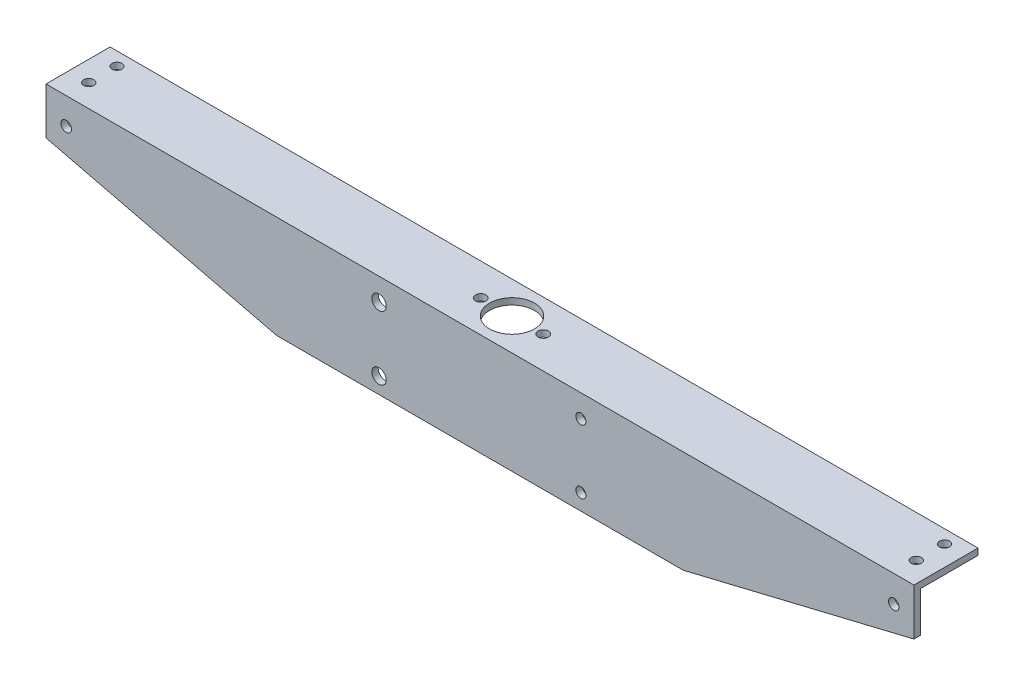
ISO-10303-21;
HEADER;
FILE_DESCRIPTION(('STEP AP214'),'2;1');
FILE_NAME('part.step','',(''),(''),'','','');
FILE_SCHEMA(('AUTOMOTIVE_DESIGN { 1 0 10303 214 1 1 1 1 }'));
ENDSEC;
DATA;
#1=APPLICATION_CONTEXT('core data for automotive mechanical design processes');
#2=APPLICATION_PROTOCOL_DEFINITION('international standard','automotive_design',2000,#1);
#3=PRODUCT_CONTEXT('',#1,'mechanical');
#4=PRODUCT('Part','Part','',(#3));
#5=PRODUCT_RELATED_PRODUCT_CATEGORY('part','',(#4));
#6=PRODUCT_DEFINITION_FORMATION('','',#4);
#7=PRODUCT_DEFINITION_CONTEXT('part definition',#1,'design');
#8=PRODUCT_DEFINITION('design','',#6,#7);
#9=PRODUCT_DEFINITION_SHAPE('','',#8);
#10=(LENGTH_UNIT() NAMED_UNIT(*) SI_UNIT(.MILLI.,.METRE.));
#11=(NAMED_UNIT(*) PLANE_ANGLE_UNIT() SI_UNIT($,.RADIAN.));
#12=(NAMED_UNIT(*) SI_UNIT($,.STERADIAN.) SOLID_ANGLE_UNIT());
#13=UNCERTAINTY_MEASURE_WITH_UNIT(LENGTH_MEASURE(1.E-05),#10,'distance_accuracy_value','');
#14=(GEOMETRIC_REPRESENTATION_CONTEXT(3) GLOBAL_UNCERTAINTY_ASSIGNED_CONTEXT((#13)) GLOBAL_UNIT_ASSIGNED_CONTEXT((#10,
#11,#12)) REPRESENTATION_CONTEXT('',''));
#15=CARTESIAN_POINT('',(0.,0.,0.));
#16=DIRECTION('',(0.,0.,1.));
#17=DIRECTION('',(1.,0.,0.));
#18=AXIS2_PLACEMENT_3D('',#15,#16,#17);
#19=CARTESIAN_POINT('',(215.,-50.8,0.));
#20=DIRECTION('',(0.,0.,-1.));
#21=DIRECTION('',(-1.,0.,0.));
#22=AXIS2_PLACEMENT_3D('',#19,#20,#21);
#23=PLANE('',#22);
#24=CARTESIAN_POINT('',(-205.,-13.1750000660001,0.));
#25=DIRECTION('',(0.,0.,1.));
#26=DIRECTION('',(-1.,0.,0.));
#27=AXIS2_PLACEMENT_3D('',#24,#25,#26);
#28=CIRCLE('',#27,2.59999999999999);
#29=CARTESIAN_POINT('',(-207.6,-13.1750000660001,0.));
#30=VERTEX_POINT('',#29);
#31=EDGE_CURVE('E213',#30,#30,#28,.T.);
#32=ORIENTED_EDGE('',*,*,#31,.F.);
#33=EDGE_LOOP('',(#32));
#34=FACE_BOUND('',#33,.T.);
#35=CARTESIAN_POINT('',(205.,-13.175000066,0.));
#36=DIRECTION('',(0.,0.,1.));
#37=DIRECTION('',(1.,0.,0.));
#38=AXIS2_PLACEMENT_3D('',#35,#36,#37);
#39=CIRCLE('',#38,2.59999999999999);
#40=CARTESIAN_POINT('',(207.6,-13.175000066,0.));
#41=VERTEX_POINT('',#40);
#42=EDGE_CURVE('E217',#41,#41,#39,.T.);
#43=ORIENTED_EDGE('',*,*,#42,.F.);
#44=EDGE_LOOP('',(#43));
#45=FACE_BOUND('',#44,.T.);
#46=CARTESIAN_POINT('',(50.,-42.8,0.));
#47=DIRECTION('',(0.,0.,-1.));
#48=DIRECTION('',(0.,1.,0.));
#49=AXIS2_PLACEMENT_3D('',#46,#47,#48);
#50=CIRCLE('',#49,2.5);
#51=CARTESIAN_POINT('',(50.,-40.3,0.));
#52=VERTEX_POINT('',#51);
#53=EDGE_CURVE('E167',#52,#52,#50,.T.);
#54=ORIENTED_EDGE('',*,*,#53,.T.);
#55=EDGE_LOOP('',(#54));
#56=FACE_BOUND('',#55,.T.);
#57=CARTESIAN_POINT('',(-50.,-42.8,0.));
#58=DIRECTION('',(0.,0.,-1.));
#59=DIRECTION('',(0.,1.,0.));
#60=AXIS2_PLACEMENT_3D('',#57,#58,#59);
#61=CIRCLE('',#60,3.57);
#62=CARTESIAN_POINT('',(-50.,-39.23,0.));
#63=VERTEX_POINT('',#62);
#64=EDGE_CURVE('E175',#63,#63,#61,.T.);
#65=ORIENTED_EDGE('',*,*,#64,.T.);
#66=EDGE_LOOP('',(#65));
#67=FACE_BOUND('',#66,.T.);
#68=CARTESIAN_POINT('',(-50.,-11.175,0.));
#69=DIRECTION('',(0.,0.,-1.));
#70=DIRECTION('',(0.,1.,0.));
#71=AXIS2_PLACEMENT_3D('',#68,#69,#70);
#72=CIRCLE('',#71,3.57);
#73=CARTESIAN_POINT('',(-50.,-7.60500000000001,0.));
#74=VERTEX_POINT('',#73);
#75=EDGE_CURVE('E181',#74,#74,#72,.T.);
#76=ORIENTED_EDGE('',*,*,#75,.T.);
#77=EDGE_LOOP('',(#76));
#78=FACE_BOUND('',#77,.T.);
#79=CARTESIAN_POINT('',(50.,-11.175,0.));
#80=DIRECTION('',(0.,0.,-1.));
#81=DIRECTION('',(0.,1.,0.));
#82=AXIS2_PLACEMENT_3D('',#79,#80,#81);
#83=CIRCLE('',#82,2.5);
#84=CARTESIAN_POINT('',(50.,-8.675,0.));
#85=VERTEX_POINT('',#84);
#86=EDGE_CURVE('E136',#85,#85,#83,.T.);
#87=ORIENTED_EDGE('',*,*,#86,.T.);
#88=EDGE_LOOP('',(#87));
#89=FACE_BOUND('',#88,.T.);
#90=DIRECTION('',(-1.,0.,0.));
#91=VECTOR('',#90,1.);
#92=CARTESIAN_POINT('',(215.,-50.8,0.));
#93=LINE('',#92,#91);
#94=CARTESIAN_POINT('',(100.7,-50.8000000000001,0.));
#95=VERTEX_POINT('',#94);
#96=CARTESIAN_POINT('',(-100.7,-50.8,0.));
#97=VERTEX_POINT('',#96);
#98=EDGE_CURVE('E11',#95,#97,#93,.T.);
#99=ORIENTED_EDGE('',*,*,#98,.F.);
#100=DIRECTION('',(0.972013609099375,0.234924549005864,0.));
#101=VECTOR('',#100,1.);
#102=CARTESIAN_POINT('',(100.7,-50.8000000000001,0.));
#103=LINE('',#102,#101);
#104=CARTESIAN_POINT('',(215.,-23.1750000000001,0.));
#105=VERTEX_POINT('',#104);
#106=EDGE_CURVE('E99',#95,#105,#103,.T.);
#107=ORIENTED_EDGE('',*,*,#106,.T.);
#108=DIRECTION('',(0.,-1.,0.));
#109=VECTOR('',#108,1.);
#110=CARTESIAN_POINT('',(215.,-50.8,0.));
#111=LINE('',#110,#109);
#112=CARTESIAN_POINT('',(215.,0.,0.));
#113=VERTEX_POINT('',#112);
#114=EDGE_CURVE('E110',#113,#105,#111,.T.);
#115=ORIENTED_EDGE('',*,*,#114,.F.);
#116=DIRECTION('',(-1.,0.,0.));
#117=VECTOR('',#116,1.);
#118=CARTESIAN_POINT('',(215.,0.,0.));
#119=LINE('',#118,#117);
#120=CARTESIAN_POINT('',(-215.,0.,0.));
#121=VERTEX_POINT('',#120);
#122=EDGE_CURVE('E131',#113,#121,#119,.T.);
#123=ORIENTED_EDGE('',*,*,#122,.T.);
#124=DIRECTION('',(0.,-1.,0.));
#125=VECTOR('',#124,1.);
#126=CARTESIAN_POINT('',(-215.,-50.8,0.));
#127=LINE('',#126,#125);
#128=CARTESIAN_POINT('',(-215.,-23.175,0.));
#129=VERTEX_POINT('',#128);
#130=EDGE_CURVE('E132',#121,#129,#127,.T.);
#131=ORIENTED_EDGE('',*,*,#130,.T.);
#132=DIRECTION('',(0.972013609099375,-0.234924549005864,0.));
#133=VECTOR('',#132,1.);
#134=CARTESIAN_POINT('',(-100.7,-50.8,0.));
#135=LINE('',#134,#133);
#136=EDGE_CURVE('E57',#129,#97,#135,.T.);
#137=ORIENTED_EDGE('',*,*,#136,.T.);
#138=EDGE_LOOP('',(#99,#107,#115,#123,#131,#137));
#139=FACE_BOUND('',#138,.T.);
#140=ADVANCED_FACE('F35',(#34,#45,#56,#67,#78,#89,#139),#23,.F.);
#141=CARTESIAN_POINT('',(215.,-50.8,-3.175));
#142=DIRECTION('',(0.,1.,0.));
#143=DIRECTION('',(0.,0.,1.));
#144=AXIS2_PLACEMENT_3D('',#141,#142,#143);
#145=PLANE('',#144);
#146=DIRECTION('',(-1.,0.,0.));
#147=VECTOR('',#146,1.);
#148=CARTESIAN_POINT('',(215.,-50.8,-3.175));
#149=LINE('',#148,#147);
#150=CARTESIAN_POINT('',(100.7,-50.8000000000001,-3.175));
#151=VERTEX_POINT('',#150);
#152=CARTESIAN_POINT('',(-100.7,-50.8,-3.175));
#153=VERTEX_POINT('',#152);
#154=EDGE_CURVE('E42',#151,#153,#149,.T.);
#155=ORIENTED_EDGE('',*,*,#154,.F.);
#156=DIRECTION('',(0.,0.,-1.));
#157=VECTOR('',#156,1.);
#158=CARTESIAN_POINT('',(100.7,-50.8000000000001,0.));
#159=LINE('',#158,#157);
#160=EDGE_CURVE('E104',#95,#151,#159,.T.);
#161=ORIENTED_EDGE('',*,*,#160,.F.);
#162=ORIENTED_EDGE('',*,*,#98,.T.);
#163=DIRECTION('',(0.,0.,-1.));
#164=VECTOR('',#163,1.);
#165=CARTESIAN_POINT('',(-100.7,-50.8,0.));
#166=LINE('',#165,#164);
#167=EDGE_CURVE('E160',#97,#153,#166,.T.);
#168=ORIENTED_EDGE('',*,*,#167,.T.);
#169=EDGE_LOOP('',(#155,#161,#162,#168));
#170=FACE_BOUND('',#169,.T.);
#171=ADVANCED_FACE('F163',(#170),#145,.F.);
#172=CARTESIAN_POINT('',(215.,-3.175,-3.17499999999999));
#173=DIRECTION('',(0.,0.,1.));
#174=DIRECTION('',(0.,-1.,0.));
#175=AXIS2_PLACEMENT_3D('',#172,#173,#174);
#176=PLANE('',#175);
#177=CARTESIAN_POINT('',(-205.,-13.1750000660001,-3.17499999999999));
#178=DIRECTION('',(0.,0.,1.));
#179=DIRECTION('',(0.,-1.,0.));
#180=AXIS2_PLACEMENT_3D('',#177,#178,#179);
#181=CIRCLE('',#180,2.59999999999999);
#182=CARTESIAN_POINT('',(-205.,-15.775000066,-3.17499999999999));
#183=VERTEX_POINT('',#182);
#184=EDGE_CURVE('E301',#183,#183,#181,.F.);
#185=ORIENTED_EDGE('',*,*,#184,.F.);
#186=EDGE_LOOP('',(#185));
#187=FACE_BOUND('',#186,.T.);
#188=CARTESIAN_POINT('',(205.,-13.175000066,-3.17499999999999));
#189=DIRECTION('',(0.,0.,1.));
#190=DIRECTION('',(0.,-1.,0.));
#191=AXIS2_PLACEMENT_3D('',#188,#189,#190);
#192=CIRCLE('',#191,2.59999999999999);
#193=CARTESIAN_POINT('',(205.,-15.775000066,-3.17499999999999));
#194=VERTEX_POINT('',#193);
#195=EDGE_CURVE('E297',#194,#194,#192,.F.);
#196=ORIENTED_EDGE('',*,*,#195,.F.);
#197=EDGE_LOOP('',(#196));
#198=FACE_BOUND('',#197,.T.);
#199=CARTESIAN_POINT('',(50.,-42.8,-3.175));
#200=DIRECTION('',(0.,0.,-1.));
#201=DIRECTION('',(0.,1.,0.));
#202=AXIS2_PLACEMENT_3D('',#199,#200,#201);
#203=CIRCLE('',#202,2.5);
#204=CARTESIAN_POINT('',(50.,-40.3,-3.175));
#205=VERTEX_POINT('',#204);
#206=EDGE_CURVE('E164',#205,#205,#203,.T.);
#207=ORIENTED_EDGE('',*,*,#206,.F.);
#208=EDGE_LOOP('',(#207));
#209=FACE_BOUND('',#208,.T.);
#210=CARTESIAN_POINT('',(-50.,-42.8,-3.175));
#211=DIRECTION('',(0.,0.,-1.));
#212=DIRECTION('',(0.,1.,0.));
#213=AXIS2_PLACEMENT_3D('',#210,#211,#212);
#214=CIRCLE('',#213,3.57);
#215=CARTESIAN_POINT('',(-50.,-39.23,-3.175));
#216=VERTEX_POINT('',#215);
#217=EDGE_CURVE('E173',#216,#216,#214,.T.);
#218=ORIENTED_EDGE('',*,*,#217,.F.);
#219=EDGE_LOOP('',(#218));
#220=FACE_BOUND('',#219,.T.);
#221=CARTESIAN_POINT('',(-50.,-11.175,-3.17499999999999));
#222=DIRECTION('',(0.,0.,-1.));
#223=DIRECTION('',(0.,1.,0.));
#224=AXIS2_PLACEMENT_3D('',#221,#222,#223);
#225=CIRCLE('',#224,3.57);
#226=CARTESIAN_POINT('',(-50.,-7.60500000000001,-3.17499999999999));
#227=VERTEX_POINT('',#226);
#228=EDGE_CURVE('E178',#227,#227,#225,.T.);
#229=ORIENTED_EDGE('',*,*,#228,.F.);
#230=EDGE_LOOP('',(#229));
#231=FACE_BOUND('',#230,.T.);
#232=CARTESIAN_POINT('',(50.,-11.175,-3.17499999999999));
#233=DIRECTION('',(0.,0.,-1.));
#234=DIRECTION('',(0.,1.,0.));
#235=AXIS2_PLACEMENT_3D('',#232,#233,#234);
#236=CIRCLE('',#235,2.5);
#237=CARTESIAN_POINT('',(50.,-8.675,-3.17499999999999));
#238=VERTEX_POINT('',#237);
#239=EDGE_CURVE('E124',#238,#238,#236,.T.);
#240=ORIENTED_EDGE('',*,*,#239,.F.);
#241=EDGE_LOOP('',(#240));
#242=FACE_BOUND('',#241,.T.);
#243=DIRECTION('',(0.,1.,0.));
#244=VECTOR('',#243,1.);
#245=CARTESIAN_POINT('',(215.,-3.175,-3.17499999999999));
#246=LINE('',#245,#244);
#247=CARTESIAN_POINT('',(215.,-23.1750000000001,-3.175));
#248=VERTEX_POINT('',#247);
#249=CARTESIAN_POINT('',(215.,-3.175,-3.17499999999999));
#250=VERTEX_POINT('',#249);
#251=EDGE_CURVE('E116',#248,#250,#246,.T.);
#252=ORIENTED_EDGE('',*,*,#251,.F.);
#253=DIRECTION('',(0.972013609099375,0.234924549005864,0.));
#254=VECTOR('',#253,1.);
#255=CARTESIAN_POINT('',(100.7,-50.8000000000001,-3.175));
#256=LINE('',#255,#254);
#257=EDGE_CURVE('E49',#151,#248,#256,.T.);
#258=ORIENTED_EDGE('',*,*,#257,.F.);
#259=ORIENTED_EDGE('',*,*,#154,.T.);
#260=DIRECTION('',(0.972013609099375,-0.234924549005864,0.));
#261=VECTOR('',#260,1.);
#262=CARTESIAN_POINT('',(-100.7,-50.8,-3.175));
#263=LINE('',#262,#261);
#264=CARTESIAN_POINT('',(-215.,-23.175,-3.17499999999999));
#265=VERTEX_POINT('',#264);
#266=EDGE_CURVE('E155',#265,#153,#263,.T.);
#267=ORIENTED_EDGE('',*,*,#266,.F.);
#268=DIRECTION('',(0.,1.,0.));
#269=VECTOR('',#268,1.);
#270=CARTESIAN_POINT('',(-215.,-3.175,-3.17499999999999));
#271=LINE('',#270,#269);
#272=CARTESIAN_POINT('',(-215.,-3.175,-3.17499999999999));
#273=VERTEX_POINT('',#272);
#274=EDGE_CURVE('E135',#265,#273,#271,.T.);
#275=ORIENTED_EDGE('',*,*,#274,.T.);
#276=DIRECTION('',(-1.,0.,0.));
#277=VECTOR('',#276,1.);
#278=CARTESIAN_POINT('',(215.,-3.175,-3.17499999999999));
#279=LINE('',#278,#277);
#280=EDGE_CURVE('E148',#250,#273,#279,.T.);
#281=ORIENTED_EDGE('',*,*,#280,.F.);
#282=EDGE_LOOP('',(#252,#258,#259,#267,#275,#281));
#283=FACE_BOUND('',#282,.T.);
#284=ADVANCED_FACE('F154',(#187,#198,#209,#220,#231,#242,#283),#176,.F.);
#285=CARTESIAN_POINT('',(215.,-3.175,-31.75));
#286=DIRECTION('',(0.,1.,0.));
#287=DIRECTION('',(0.,0.,1.));
#288=AXIS2_PLACEMENT_3D('',#285,#286,#287);
#289=PLANE('',#288);
#290=CARTESIAN_POINT('',(-15.5,-3.175,-15.875));
#291=DIRECTION('',(0.,1.,0.));
#292=DIRECTION('',(0.,0.,1.));
#293=AXIS2_PLACEMENT_3D('',#290,#291,#292);
#294=CIRCLE('',#293,2.6);
#295=CARTESIAN_POINT('',(-15.5,-3.175,-13.275));
#296=VERTEX_POINT('',#295);
#297=EDGE_CURVE('E311',#296,#296,#294,.F.);
#298=ORIENTED_EDGE('',*,*,#297,.F.);
#299=EDGE_LOOP('',(#298));
#300=FACE_BOUND('',#299,.T.);
#301=CARTESIAN_POINT('',(15.5,-3.175,-15.875));
#302=DIRECTION('',(0.,1.,0.));
#303=DIRECTION('',(0.,0.,1.));
#304=AXIS2_PLACEMENT_3D('',#301,#302,#303);
#305=CIRCLE('',#304,2.6);
#306=CARTESIAN_POINT('',(15.5,-3.175,-13.275));
#307=VERTEX_POINT('',#306);
#308=EDGE_CURVE('E305',#307,#307,#305,.F.);
#309=ORIENTED_EDGE('',*,*,#308,.F.);
#310=EDGE_LOOP('',(#309));
#311=FACE_BOUND('',#310,.T.);
#312=CARTESIAN_POINT('',(0.,-3.175,-15.875));
#313=DIRECTION('',(0.,-1.,0.));
#314=DIRECTION('',(0.,0.,-1.));
#315=AXIS2_PLACEMENT_3D('',#312,#313,#314);
#316=CIRCLE('',#315,11.1125);
#317=CARTESIAN_POINT('',(0.,-3.175,-26.9875));
#318=VERTEX_POINT('',#317);
#319=EDGE_CURVE('E294',#318,#318,#316,.T.);
#320=ORIENTED_EDGE('',*,*,#319,.F.);
#321=EDGE_LOOP('',(#320));
#322=FACE_BOUND('',#321,.T.);
#323=CARTESIAN_POINT('',(205.,-3.175,-11.176));
#324=DIRECTION('',(0.,1.,0.));
#325=DIRECTION('',(0.,0.,-1.));
#326=AXIS2_PLACEMENT_3D('',#323,#324,#325);
#327=CIRCLE('',#326,2.5);
#328=CARTESIAN_POINT('',(205.,-3.175,-13.676));
#329=VERTEX_POINT('',#328);
#330=EDGE_CURVE('E283',#329,#329,#327,.T.);
#331=ORIENTED_EDGE('',*,*,#330,.T.);
#332=EDGE_LOOP('',(#331));
#333=FACE_BOUND('',#332,.T.);
#334=CARTESIAN_POINT('',(205.,-3.175,-25.176));
#335=DIRECTION('',(0.,1.,0.));
#336=DIRECTION('',(0.,0.,-1.));
#337=AXIS2_PLACEMENT_3D('',#334,#335,#336);
#338=CIRCLE('',#337,2.5);
#339=CARTESIAN_POINT('',(205.,-3.175,-27.676));
#340=VERTEX_POINT('',#339);
#341=EDGE_CURVE('E277',#340,#340,#338,.T.);
#342=ORIENTED_EDGE('',*,*,#341,.T.);
#343=EDGE_LOOP('',(#342));
#344=FACE_BOUND('',#343,.T.);
#345=CARTESIAN_POINT('',(-205.,-3.175,-25.176));
#346=DIRECTION('',(0.,1.,0.));
#347=DIRECTION('',(0.,0.,1.));
#348=AXIS2_PLACEMENT_3D('',#345,#346,#347);
#349=CIRCLE('',#348,2.5);
#350=CARTESIAN_POINT('',(-205.,-3.175,-22.676));
#351=VERTEX_POINT('',#350);
#352=EDGE_CURVE('E271',#351,#351,#349,.T.);
#353=ORIENTED_EDGE('',*,*,#352,.T.);
#354=EDGE_LOOP('',(#353));
#355=FACE_BOUND('',#354,.T.);
#356=CARTESIAN_POINT('',(-205.,-3.175,-11.176));
#357=DIRECTION('',(0.,1.,0.));
#358=DIRECTION('',(0.,0.,1.));
#359=AXIS2_PLACEMENT_3D('',#356,#357,#358);
#360=CIRCLE('',#359,2.5);
#361=CARTESIAN_POINT('',(-205.,-3.175,-8.67600000000001));
#362=VERTEX_POINT('',#361);
#363=EDGE_CURVE('E266',#362,#362,#360,.T.);
#364=ORIENTED_EDGE('',*,*,#363,.T.);
#365=EDGE_LOOP('',(#364));
#366=FACE_BOUND('',#365,.T.);
#367=DIRECTION('',(0.,0.,-1.));
#368=VECTOR('',#367,1.);
#369=CARTESIAN_POINT('',(-215.,-3.175,-31.75));
#370=LINE('',#369,#368);
#371=CARTESIAN_POINT('',(-215.,-3.175,-31.75));
#372=VERTEX_POINT('',#371);
#373=EDGE_CURVE('E138',#273,#372,#370,.T.);
#374=ORIENTED_EDGE('',*,*,#373,.T.);
#375=DIRECTION('',(-1.,0.,0.));
#376=VECTOR('',#375,1.);
#377=CARTESIAN_POINT('',(215.,-3.175,-31.75));
#378=LINE('',#377,#376);
#379=CARTESIAN_POINT('',(215.,-3.175,-31.75));
#380=VERTEX_POINT('',#379);
#381=EDGE_CURVE('E145',#380,#372,#378,.T.);
#382=ORIENTED_EDGE('',*,*,#381,.F.);
#383=DIRECTION('',(0.,0.,-1.));
#384=VECTOR('',#383,1.);
#385=CARTESIAN_POINT('',(215.,-3.175,-31.75));
#386=LINE('',#385,#384);
#387=EDGE_CURVE('E119',#250,#380,#386,.T.);
#388=ORIENTED_EDGE('',*,*,#387,.F.);
#389=ORIENTED_EDGE('',*,*,#280,.T.);
#390=EDGE_LOOP('',(#374,#382,#388,#389));
#391=FACE_BOUND('',#390,.T.);
#392=ADVANCED_FACE('F194',(#300,#311,#322,#333,#344,#355,#366,#391),#289,.F.);
#393=CARTESIAN_POINT('',(215.,0.,-31.75));
#394=DIRECTION('',(0.,0.,1.));
#395=DIRECTION('',(1.,0.,0.));
#396=AXIS2_PLACEMENT_3D('',#393,#394,#395);
#397=PLANE('',#396);
#398=DIRECTION('',(0.,1.,0.));
#399=VECTOR('',#398,1.);
#400=CARTESIAN_POINT('',(-215.,0.,-31.75));
#401=LINE('',#400,#399);
#402=CARTESIAN_POINT('',(-215.,0.,-31.75));
#403=VERTEX_POINT('',#402);
#404=EDGE_CURVE('E121',#372,#403,#401,.T.);
#405=ORIENTED_EDGE('',*,*,#404,.T.);
#406=DIRECTION('',(-1.,0.,0.));
#407=VECTOR('',#406,1.);
#408=CARTESIAN_POINT('',(215.,0.,-31.75));
#409=LINE('',#408,#407);
#410=CARTESIAN_POINT('',(215.,0.,-31.75));
#411=VERTEX_POINT('',#410);
#412=EDGE_CURVE('E142',#411,#403,#409,.T.);
#413=ORIENTED_EDGE('',*,*,#412,.F.);
#414=DIRECTION('',(0.,1.,0.));
#415=VECTOR('',#414,1.);
#416=CARTESIAN_POINT('',(215.,0.,-31.75));
#417=LINE('',#416,#415);
#418=EDGE_CURVE('E128',#380,#411,#417,.T.);
#419=ORIENTED_EDGE('',*,*,#418,.F.);
#420=ORIENTED_EDGE('',*,*,#381,.T.);
#421=EDGE_LOOP('',(#405,#413,#419,#420));
#422=FACE_BOUND('',#421,.T.);
#423=ADVANCED_FACE('F201',(#422),#397,.F.);
#424=CARTESIAN_POINT('',(215.,0.,0.));
#425=DIRECTION('',(0.,-1.,0.));
#426=DIRECTION('',(0.,0.,-1.));
#427=AXIS2_PLACEMENT_3D('',#424,#425,#426);
#428=PLANE('',#427);
#429=CARTESIAN_POINT('',(-15.5,0.,-15.875));
#430=DIRECTION('',(0.,1.,0.));
#431=DIRECTION('',(0.,0.,1.));
#432=AXIS2_PLACEMENT_3D('',#429,#430,#431);
#433=CIRCLE('',#432,2.6);
#434=CARTESIAN_POINT('',(-15.5,0.,-13.275));
#435=VERTEX_POINT('',#434);
#436=EDGE_CURVE('E314',#435,#435,#433,.T.);
#437=ORIENTED_EDGE('',*,*,#436,.F.);
#438=EDGE_LOOP('',(#437));
#439=FACE_BOUND('',#438,.T.);
#440=CARTESIAN_POINT('',(15.5,0.,-15.875));
#441=DIRECTION('',(0.,1.,0.));
#442=DIRECTION('',(0.,0.,1.));
#443=AXIS2_PLACEMENT_3D('',#440,#441,#442);
#444=CIRCLE('',#443,2.6);
#445=CARTESIAN_POINT('',(15.5,0.,-13.275));
#446=VERTEX_POINT('',#445);
#447=EDGE_CURVE('E308',#446,#446,#444,.T.);
#448=ORIENTED_EDGE('',*,*,#447,.F.);
#449=EDGE_LOOP('',(#448));
#450=FACE_BOUND('',#449,.T.);
#451=CARTESIAN_POINT('',(0.,0.,-15.875));
#452=DIRECTION('',(0.,-1.,0.));
#453=DIRECTION('',(0.,0.,-1.));
#454=AXIS2_PLACEMENT_3D('',#451,#452,#453);
#455=CIRCLE('',#454,11.1125);
#456=CARTESIAN_POINT('',(0.,0.,-26.9875));
#457=VERTEX_POINT('',#456);
#458=EDGE_CURVE('E289',#457,#457,#455,.F.);
#459=ORIENTED_EDGE('',*,*,#458,.F.);
#460=EDGE_LOOP('',(#459));
#461=FACE_BOUND('',#460,.T.);
#462=CARTESIAN_POINT('',(205.,0.,-11.176));
#463=DIRECTION('',(0.,1.,0.));
#464=DIRECTION('',(0.,0.,-1.));
#465=AXIS2_PLACEMENT_3D('',#462,#463,#464);
#466=CIRCLE('',#465,2.5);
#467=CARTESIAN_POINT('',(205.,0.,-13.676));
#468=VERTEX_POINT('',#467);
#469=EDGE_CURVE('E286',#468,#468,#466,.T.);
#470=ORIENTED_EDGE('',*,*,#469,.F.);
#471=EDGE_LOOP('',(#470));
#472=FACE_BOUND('',#471,.T.);
#473=CARTESIAN_POINT('',(205.,0.,-25.176));
#474=DIRECTION('',(0.,1.,0.));
#475=DIRECTION('',(0.,0.,-1.));
#476=AXIS2_PLACEMENT_3D('',#473,#474,#475);
#477=CIRCLE('',#476,2.5);
#478=CARTESIAN_POINT('',(205.,0.,-27.676));
#479=VERTEX_POINT('',#478);
#480=EDGE_CURVE('E280',#479,#479,#477,.T.);
#481=ORIENTED_EDGE('',*,*,#480,.F.);
#482=EDGE_LOOP('',(#481));
#483=FACE_BOUND('',#482,.T.);
#484=CARTESIAN_POINT('',(-205.,0.,-25.176));
#485=DIRECTION('',(0.,1.,0.));
#486=DIRECTION('',(0.,0.,1.));
#487=AXIS2_PLACEMENT_3D('',#484,#485,#486);
#488=CIRCLE('',#487,2.5);
#489=CARTESIAN_POINT('',(-205.,0.,-22.676));
#490=VERTEX_POINT('',#489);
#491=EDGE_CURVE('E274',#490,#490,#488,.T.);
#492=ORIENTED_EDGE('',*,*,#491,.F.);
#493=EDGE_LOOP('',(#492));
#494=FACE_BOUND('',#493,.T.);
#495=CARTESIAN_POINT('',(-205.,0.,-11.176));
#496=DIRECTION('',(0.,1.,0.));
#497=DIRECTION('',(0.,0.,1.));
#498=AXIS2_PLACEMENT_3D('',#495,#496,#497);
#499=CIRCLE('',#498,2.5);
#500=CARTESIAN_POINT('',(-205.,0.,-8.67600000000001));
#501=VERTEX_POINT('',#500);
#502=EDGE_CURVE('E268',#501,#501,#499,.T.);
#503=ORIENTED_EDGE('',*,*,#502,.F.);
#504=EDGE_LOOP('',(#503));
#505=FACE_BOUND('',#504,.T.);
#506=DIRECTION('',(0.,0.,1.));
#507=VECTOR('',#506,1.);
#508=CARTESIAN_POINT('',(-215.,0.,0.));
#509=LINE('',#508,#507);
#510=EDGE_CURVE('E117',#403,#121,#509,.T.);
#511=ORIENTED_EDGE('',*,*,#510,.T.);
#512=ORIENTED_EDGE('',*,*,#122,.F.);
#513=DIRECTION('',(0.,0.,1.));
#514=VECTOR('',#513,1.);
#515=CARTESIAN_POINT('',(215.,0.,0.));
#516=LINE('',#515,#514);
#517=EDGE_CURVE('E114',#411,#113,#516,.T.);
#518=ORIENTED_EDGE('',*,*,#517,.F.);
#519=ORIENTED_EDGE('',*,*,#412,.T.);
#520=EDGE_LOOP('',(#511,#512,#518,#519));
#521=FACE_BOUND('',#520,.T.);
#522=ADVANCED_FACE('F245',(#439,#450,#461,#472,#483,#494,#505,#521),#428,.F.);
#523=CARTESIAN_POINT('',(215.,0.,0.));
#524=DIRECTION('',(-1.,0.,0.));
#525=DIRECTION('',(0.,0.,1.));
#526=AXIS2_PLACEMENT_3D('',#523,#524,#525);
#527=PLANE('',#526);
#528=ORIENTED_EDGE('',*,*,#114,.T.);
#529=DIRECTION('',(0.,0.,-1.));
#530=VECTOR('',#529,1.);
#531=CARTESIAN_POINT('',(215.,-23.1750000000001,0.));
#532=LINE('',#531,#530);
#533=EDGE_CURVE('E96',#105,#248,#532,.T.);
#534=ORIENTED_EDGE('',*,*,#533,.T.);
#535=ORIENTED_EDGE('',*,*,#251,.T.);
#536=ORIENTED_EDGE('',*,*,#387,.T.);
#537=ORIENTED_EDGE('',*,*,#418,.T.);
#538=ORIENTED_EDGE('',*,*,#517,.T.);
#539=EDGE_LOOP('',(#528,#534,#535,#536,#537,#538));
#540=FACE_BOUND('',#539,.T.);
#541=ADVANCED_FACE('F112',(#540),#527,.F.);
#542=CARTESIAN_POINT('',(-215.,0.,0.));
#543=DIRECTION('',(-1.,0.,0.));
#544=DIRECTION('',(0.,0.,1.));
#545=AXIS2_PLACEMENT_3D('',#542,#543,#544);
#546=PLANE('',#545);
#547=DIRECTION('',(0.,0.,-1.));
#548=VECTOR('',#547,1.);
#549=CARTESIAN_POINT('',(-215.,-23.175,0.));
#550=LINE('',#549,#548);
#551=EDGE_CURVE('E161',#129,#265,#550,.T.);
#552=ORIENTED_EDGE('',*,*,#551,.F.);
#553=ORIENTED_EDGE('',*,*,#130,.F.);
#554=ORIENTED_EDGE('',*,*,#510,.F.);
#555=ORIENTED_EDGE('',*,*,#404,.F.);
#556=ORIENTED_EDGE('',*,*,#373,.F.);
#557=ORIENTED_EDGE('',*,*,#274,.F.);
#558=EDGE_LOOP('',(#552,#553,#554,#555,#556,#557));
#559=FACE_BOUND('',#558,.T.);
#560=ADVANCED_FACE('F238',(#559),#546,.T.);
#561=CARTESIAN_POINT('',(50.,-11.175,0.));
#562=DIRECTION('',(0.,0.,-1.));
#563=DIRECTION('',(0.,1.,0.));
#564=AXIS2_PLACEMENT_3D('',#561,#562,#563);
#565=CYLINDRICAL_SURFACE('',#564,2.5);
#566=ORIENTED_EDGE('',*,*,#86,.F.);
#567=EDGE_LOOP('',(#566));
#568=FACE_BOUND('',#567,.T.);
#569=ORIENTED_EDGE('',*,*,#239,.T.);
#570=EDGE_LOOP('',(#569));
#571=FACE_BOUND('',#570,.T.);
#572=ADVANCED_FACE('F191',(#568,#571),#565,.F.);
#573=CARTESIAN_POINT('',(-50.,-11.175,0.));
#574=DIRECTION('',(0.,0.,-1.));
#575=DIRECTION('',(0.,1.,0.));
#576=AXIS2_PLACEMENT_3D('',#573,#574,#575);
#577=CYLINDRICAL_SURFACE('',#576,3.57);
#578=ORIENTED_EDGE('',*,*,#75,.F.);
#579=EDGE_LOOP('',(#578));
#580=FACE_BOUND('',#579,.T.);
#581=ORIENTED_EDGE('',*,*,#228,.T.);
#582=EDGE_LOOP('',(#581));
#583=FACE_BOUND('',#582,.T.);
#584=ADVANCED_FACE('F224',(#580,#583),#577,.F.);
#585=CARTESIAN_POINT('',(-50.,-42.8,0.));
#586=DIRECTION('',(0.,0.,-1.));
#587=DIRECTION('',(0.,1.,0.));
#588=AXIS2_PLACEMENT_3D('',#585,#586,#587);
#589=CYLINDRICAL_SURFACE('',#588,3.57);
#590=ORIENTED_EDGE('',*,*,#64,.F.);
#591=EDGE_LOOP('',(#590));
#592=FACE_BOUND('',#591,.T.);
#593=ORIENTED_EDGE('',*,*,#217,.T.);
#594=EDGE_LOOP('',(#593));
#595=FACE_BOUND('',#594,.T.);
#596=ADVANCED_FACE('F227',(#592,#595),#589,.F.);
#597=CARTESIAN_POINT('',(50.,-42.8,0.));
#598=DIRECTION('',(0.,0.,-1.));
#599=DIRECTION('',(0.,1.,0.));
#600=AXIS2_PLACEMENT_3D('',#597,#598,#599);
#601=CYLINDRICAL_SURFACE('',#600,2.5);
#602=ORIENTED_EDGE('',*,*,#53,.F.);
#603=EDGE_LOOP('',(#602));
#604=FACE_BOUND('',#603,.T.);
#605=ORIENTED_EDGE('',*,*,#206,.T.);
#606=EDGE_LOOP('',(#605));
#607=FACE_BOUND('',#606,.T.);
#608=ADVANCED_FACE('F235',(#604,#607),#601,.F.);
#609=CARTESIAN_POINT('',(-100.7,-50.8,0.));
#610=DIRECTION('',(0.234924549005864,0.972013609099374,0.));
#611=DIRECTION('',(-0.972013609099374,0.234924549005864,0.));
#612=AXIS2_PLACEMENT_3D('',#609,#610,#611);
#613=PLANE('',#612);
#614=ORIENTED_EDGE('',*,*,#266,.T.);
#615=ORIENTED_EDGE('',*,*,#167,.F.);
#616=ORIENTED_EDGE('',*,*,#136,.F.);
#617=ORIENTED_EDGE('',*,*,#551,.T.);
#618=EDGE_LOOP('',(#614,#615,#616,#617));
#619=FACE_BOUND('',#618,.T.);
#620=ADVANCED_FACE('F159',(#619),#613,.F.);
#621=CARTESIAN_POINT('',(100.7,-50.8000000000001,0.));
#622=DIRECTION('',(-0.234924549005864,0.972013609099374,0.));
#623=DIRECTION('',(-0.972013609099375,-0.234924549005864,0.));
#624=AXIS2_PLACEMENT_3D('',#621,#622,#623);
#625=PLANE('',#624);
#626=ORIENTED_EDGE('',*,*,#257,.T.);
#627=ORIENTED_EDGE('',*,*,#533,.F.);
#628=ORIENTED_EDGE('',*,*,#106,.F.);
#629=ORIENTED_EDGE('',*,*,#160,.T.);
#630=EDGE_LOOP('',(#626,#627,#628,#629));
#631=FACE_BOUND('',#630,.T.);
#632=ADVANCED_FACE('F98',(#631),#625,.F.);
#633=CARTESIAN_POINT('',(-205.,-3.175,-11.176));
#634=DIRECTION('',(0.,1.,0.));
#635=DIRECTION('',(0.,0.,1.));
#636=AXIS2_PLACEMENT_3D('',#633,#634,#635);
#637=CYLINDRICAL_SURFACE('',#636,2.5);
#638=ORIENTED_EDGE('',*,*,#363,.F.);
#639=EDGE_LOOP('',(#638));
#640=FACE_BOUND('',#639,.T.);
#641=ORIENTED_EDGE('',*,*,#502,.T.);
#642=EDGE_LOOP('',(#641));
#643=FACE_BOUND('',#642,.T.);
#644=ADVANCED_FACE('F332',(#640,#643),#637,.F.);
#645=CARTESIAN_POINT('',(-205.,-3.175,-25.176));
#646=DIRECTION('',(0.,1.,0.));
#647=DIRECTION('',(0.,0.,1.));
#648=AXIS2_PLACEMENT_3D('',#645,#646,#647);
#649=CYLINDRICAL_SURFACE('',#648,2.5);
#650=ORIENTED_EDGE('',*,*,#352,.F.);
#651=EDGE_LOOP('',(#650));
#652=FACE_BOUND('',#651,.T.);
#653=ORIENTED_EDGE('',*,*,#491,.T.);
#654=EDGE_LOOP('',(#653));
#655=FACE_BOUND('',#654,.T.);
#656=ADVANCED_FACE('F334',(#652,#655),#649,.F.);
#657=CARTESIAN_POINT('',(205.,-3.175,-25.176));
#658=DIRECTION('',(0.,1.,0.));
#659=DIRECTION('',(0.,0.,1.));
#660=AXIS2_PLACEMENT_3D('',#657,#658,#659);
#661=CYLINDRICAL_SURFACE('',#660,2.5);
#662=ORIENTED_EDGE('',*,*,#341,.F.);
#663=EDGE_LOOP('',(#662));
#664=FACE_BOUND('',#663,.T.);
#665=ORIENTED_EDGE('',*,*,#480,.T.);
#666=EDGE_LOOP('',(#665));
#667=FACE_BOUND('',#666,.T.);
#668=ADVANCED_FACE('F341',(#664,#667),#661,.F.);
#669=CARTESIAN_POINT('',(205.,-3.175,-11.176));
#670=DIRECTION('',(0.,1.,0.));
#671=DIRECTION('',(0.,0.,1.));
#672=AXIS2_PLACEMENT_3D('',#669,#670,#671);
#673=CYLINDRICAL_SURFACE('',#672,2.5);
#674=ORIENTED_EDGE('',*,*,#330,.F.);
#675=EDGE_LOOP('',(#674));
#676=FACE_BOUND('',#675,.T.);
#677=ORIENTED_EDGE('',*,*,#469,.T.);
#678=EDGE_LOOP('',(#677));
#679=FACE_BOUND('',#678,.T.);
#680=ADVANCED_FACE('F390',(#676,#679),#673,.F.);
#681=CARTESIAN_POINT('',(0.,0.0010000000000023,-15.875));
#682=DIRECTION('',(0.,-1.,0.));
#683=DIRECTION('',(0.,0.,-1.));
#684=AXIS2_PLACEMENT_3D('',#681,#682,#683);
#685=CYLINDRICAL_SURFACE('',#684,11.1125);
#686=ORIENTED_EDGE('',*,*,#319,.T.);
#687=EDGE_LOOP('',(#686));
#688=FACE_BOUND('',#687,.T.);
#689=ORIENTED_EDGE('',*,*,#458,.T.);
#690=EDGE_LOOP('',(#689));
#691=FACE_BOUND('',#690,.T.);
#692=ADVANCED_FACE('F399',(#688,#691),#685,.F.);
#693=CARTESIAN_POINT('',(205.,-13.175000066,-10.5289105243401));
#694=DIRECTION('',(0.,0.,1.));
#695=DIRECTION('',(1.,0.,0.));
#696=AXIS2_PLACEMENT_3D('',#693,#694,#695);
#697=CYLINDRICAL_SURFACE('',#696,2.59999999999999);
#698=ORIENTED_EDGE('',*,*,#195,.T.);
#699=EDGE_LOOP('',(#698));
#700=FACE_BOUND('',#699,.T.);
#701=ORIENTED_EDGE('',*,*,#42,.T.);
#702=EDGE_LOOP('',(#701));
#703=FACE_BOUND('',#702,.T.);
#704=ADVANCED_FACE('F408',(#700,#703),#697,.F.);
#705=CARTESIAN_POINT('',(-205.,-13.1750000660001,-10.5289105243401));
#706=DIRECTION('',(0.,0.,1.));
#707=DIRECTION('',(1.,0.,0.));
#708=AXIS2_PLACEMENT_3D('',#705,#706,#707);
#709=CYLINDRICAL_SURFACE('',#708,2.59999999999999);
#710=ORIENTED_EDGE('',*,*,#184,.T.);
#711=EDGE_LOOP('',(#710));
#712=FACE_BOUND('',#711,.T.);
#713=ORIENTED_EDGE('',*,*,#31,.T.);
#714=EDGE_LOOP('',(#713));
#715=FACE_BOUND('',#714,.T.);
#716=ADVANCED_FACE('F429',(#712,#715),#709,.F.);
#717=CARTESIAN_POINT('',(15.5,-10.5289105243401,-15.875));
#718=DIRECTION('',(0.,1.,0.));
#719=DIRECTION('',(0.,0.,1.));
#720=AXIS2_PLACEMENT_3D('',#717,#718,#719);
#721=CYLINDRICAL_SURFACE('',#720,2.6);
#722=ORIENTED_EDGE('',*,*,#308,.T.);
#723=EDGE_LOOP('',(#722));
#724=FACE_BOUND('',#723,.T.);
#725=ORIENTED_EDGE('',*,*,#447,.T.);
#726=EDGE_LOOP('',(#725));
#727=FACE_BOUND('',#726,.T.);
#728=ADVANCED_FACE('F439',(#724,#727),#721,.F.);
#729=CARTESIAN_POINT('',(-15.5,-10.5289105243401,-15.875));
#730=DIRECTION('',(0.,1.,0.));
#731=DIRECTION('',(0.,0.,1.));
#732=AXIS2_PLACEMENT_3D('',#729,#730,#731);
#733=CYLINDRICAL_SURFACE('',#732,2.6);
#734=ORIENTED_EDGE('',*,*,#297,.T.);
#735=EDGE_LOOP('',(#734));
#736=FACE_BOUND('',#735,.T.);
#737=ORIENTED_EDGE('',*,*,#436,.T.);
#738=EDGE_LOOP('',(#737));
#739=FACE_BOUND('',#738,.T.);
#740=ADVANCED_FACE('F318',(#736,#739),#733,.F.);
#741=CLOSED_SHELL('',(#140,#171,#284,#392,#423,#522,#541,#560,#572,#584,#596,#608,#620,#632,
#644,#656,#668,#680,#692,#704,#716,#728,#740));
#742=MANIFOLD_SOLID_BREP('B2',#741);
#743=ADVANCED_BREP_SHAPE_REPRESENTATION('',(#18,#742),#14);
#744=SHAPE_DEFINITION_REPRESENTATION(#9,#743);
ENDSEC;
END-ISO-10303-21;
